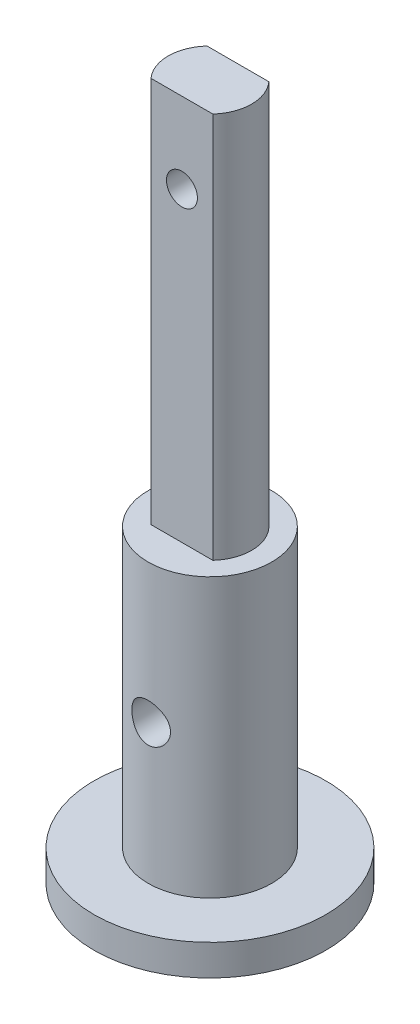
ISO-10303-21;
HEADER;
FILE_DESCRIPTION(('STEP AP214'),'2;1');
FILE_NAME('part.step','',(''),(''),'','','');
FILE_SCHEMA(('AUTOMOTIVE_DESIGN { 1 0 10303 214 1 1 1 1 }'));
ENDSEC;
DATA;
#1=APPLICATION_CONTEXT('core data for automotive mechanical design processes');
#2=APPLICATION_PROTOCOL_DEFINITION('international standard','automotive_design',2000,#1);
#3=PRODUCT_CONTEXT('',#1,'mechanical');
#4=PRODUCT('Part','Part','',(#3));
#5=PRODUCT_RELATED_PRODUCT_CATEGORY('part','',(#4));
#6=PRODUCT_DEFINITION_FORMATION('','',#4);
#7=PRODUCT_DEFINITION_CONTEXT('part definition',#1,'design');
#8=PRODUCT_DEFINITION('design','',#6,#7);
#9=PRODUCT_DEFINITION_SHAPE('','',#8);
#10=(LENGTH_UNIT() NAMED_UNIT(*) SI_UNIT(.MILLI.,.METRE.));
#11=(NAMED_UNIT(*) PLANE_ANGLE_UNIT() SI_UNIT($,.RADIAN.));
#12=(NAMED_UNIT(*) SI_UNIT($,.STERADIAN.) SOLID_ANGLE_UNIT());
#13=UNCERTAINTY_MEASURE_WITH_UNIT(LENGTH_MEASURE(1.E-05),#10,'distance_accuracy_value','');
#14=(GEOMETRIC_REPRESENTATION_CONTEXT(3) GLOBAL_UNCERTAINTY_ASSIGNED_CONTEXT((#13)) GLOBAL_UNIT_ASSIGNED_CONTEXT((#10,
#11,#12)) REPRESENTATION_CONTEXT('',''));
#15=CARTESIAN_POINT('',(0.,0.,0.));
#16=DIRECTION('',(0.,0.,1.));
#17=DIRECTION('',(1.,0.,0.));
#18=AXIS2_PLACEMENT_3D('',#15,#16,#17);
#19=CARTESIAN_POINT('',(0.,45.,0.));
#20=DIRECTION('',(0.,-1.,0.));
#21=DIRECTION('',(0.,0.,-1.));
#22=AXIS2_PLACEMENT_3D('',#19,#20,#21);
#23=CYLINDRICAL_SURFACE('',#22,4.);
#24=CARTESIAN_POINT('',(0.,2.,0.));
#25=DIRECTION('',(0.,1.,0.));
#26=DIRECTION('',(0.,0.,1.));
#27=AXIS2_PLACEMENT_3D('',#24,#25,#26);
#28=CIRCLE('',#27,4.);
#29=CARTESIAN_POINT('',(0.,2.,4.));
#30=VERTEX_POINT('',#29);
#31=EDGE_CURVE('E126',#30,#30,#28,.T.);
#32=ORIENTED_EDGE('',*,*,#31,.T.);
#33=EDGE_LOOP('',(#32));
#34=FACE_BOUND('',#33,.T.);
#35=CARTESIAN_POINT('',(0.,20.,0.));
#36=DIRECTION('',(0.,1.,0.));
#37=DIRECTION('',(0.,0.,1.));
#38=AXIS2_PLACEMENT_3D('',#35,#36,#37);
#39=CIRCLE('',#38,4.);
#40=CARTESIAN_POINT('',(0.,20.,4.));
#41=VERTEX_POINT('',#40);
#42=EDGE_CURVE('E122',#41,#41,#39,.T.);
#43=ORIENTED_EDGE('',*,*,#42,.F.);
#44=EDGE_LOOP('',(#43));
#45=FACE_BOUND('',#44,.T.);
#46=CARTESIAN_POINT('',(1.24999999999999,11.,3.79967103839267));
#47=CARTESIAN_POINT('',(1.24999953780047,11.0683470361093,3.79967145961937));
#48=CARTESIAN_POINT('',(1.24437538791494,11.1366987687032,3.80153531505043));
#49=CARTESIAN_POINT('',(1.22209175401326,11.2713941608778,3.80875638998877));
#50=CARTESIAN_POINT('',(1.20542928782514,11.3377372727322,3.81411455353136));
#51=CARTESIAN_POINT('',(1.16169788223558,11.466444901932,3.8276593883596));
#52=CARTESIAN_POINT('',(1.13464735736676,11.5288162331057,3.83584105194317));
#53=CARTESIAN_POINT('',(1.07096914173156,11.648152695864,3.85410406218688));
#54=CARTESIAN_POINT('',(1.03433975905631,11.7051168699601,3.86418574435841));
#55=CARTESIAN_POINT('',(0.951196070622286,11.8139788674935,3.8855012766862));
#56=CARTESIAN_POINT('',(0.904409399720391,11.865663609436,3.8967612338478));
#57=CARTESIAN_POINT('',(0.802862046455487,11.9605960132092,3.91894245860336));
#58=CARTESIAN_POINT('',(0.748100252518558,12.0038424969448,3.92986367872627));
#59=CARTESIAN_POINT('',(0.630625912493356,12.0816110630112,3.95043553390078));
#60=CARTESIAN_POINT('',(0.567761556520088,12.1159137038315,3.9600518456278));
#61=CARTESIAN_POINT('',(0.436804232853397,12.1733760498555,3.97662551833019));
#62=CARTESIAN_POINT('',(0.368712498487045,12.1965383741496,3.9835835041992));
#63=CARTESIAN_POINT('',(0.231464356966091,12.2303511280971,3.99387175820862));
#64=CARTESIAN_POINT('',(0.162405715468209,12.2413657497878,3.99730738984143));
#65=CARTESIAN_POINT('',(0.0233408139845136,12.2517243464375,4.00053595876015));
#66=CARTESIAN_POINT('',(-0.0466652269730901,12.2510709743588,4.00032972410065));
#67=CARTESIAN_POINT('',(-0.183074480354741,12.2383517084141,3.99637116132537));
#68=CARTESIAN_POINT('',(-0.24951863431405,12.226680616487,3.99274150972157));
#69=CARTESIAN_POINT('',(-0.379453063347776,12.192905009957,3.98249482560855));
#70=CARTESIAN_POINT('',(-0.442943145481202,12.1707998149134,3.97587759827134));
#71=CARTESIAN_POINT('',(-0.566078103154787,12.1165298109251,3.96023459729533));
#72=CARTESIAN_POINT('',(-0.625666405622837,12.084245191437,3.95118033616957));
#73=CARTESIAN_POINT('',(-0.738702511152035,12.0106289002954,3.93161722953562));
#74=CARTESIAN_POINT('',(-0.792148756208844,11.9692949408622,3.92110801644584));
#75=CARTESIAN_POINT('',(-0.893737698453887,11.8767263651987,3.89923670734646));
#76=CARTESIAN_POINT('',(-0.941566549094185,11.8251509311588,3.88785731989084));
#77=CARTESIAN_POINT('',(-1.02798974259538,11.7146048981755,3.86590615440412));
#78=CARTESIAN_POINT('',(-1.06658299775342,11.655633429425,3.85533447159846));
#79=CARTESIAN_POINT('',(-1.13380465019766,11.5310825311402,3.83610846648974));
#80=CARTESIAN_POINT('',(-1.16231680702683,11.4654365909576,3.82747690354323));
#81=CARTESIAN_POINT('',(-1.20778345948514,11.3299405081046,3.81337545338913));
#82=CARTESIAN_POINT('',(-1.22474210765794,11.2600918857895,3.80790443033293));
#83=CARTESIAN_POINT('',(-1.24601485185709,11.1211800474342,3.80099563391872));
#84=CARTESIAN_POINT('',(-1.25080954353711,11.0521980037679,3.79940466389696));
#85=CARTESIAN_POINT('',(-1.24896744498308,10.9144102585018,3.80001077463984));
#86=CARTESIAN_POINT('',(-1.24233242111456,10.8456045312995,3.80220727008389));
#87=CARTESIAN_POINT('',(-1.21824873513144,10.7121917033483,3.80998957482874));
#88=CARTESIAN_POINT('',(-1.20111831160538,10.647520725926,3.81547554101732));
#89=CARTESIAN_POINT('',(-1.15690373661028,10.521978208004,3.8291128733166));
#90=CARTESIAN_POINT('',(-1.12981796171155,10.4611072890788,3.83726467412387));
#91=CARTESIAN_POINT('',(-1.06557510655875,10.3429608902282,3.85560539653156));
#92=CARTESIAN_POINT('',(-1.02815147488558,10.2858385844072,3.86584603489733));
#93=CARTESIAN_POINT('',(-0.944606408679818,10.1785096536381,3.88710348972828));
#94=CARTESIAN_POINT('',(-0.89848271469079,10.1283048310747,3.89812050735703));
#95=CARTESIAN_POINT('',(-0.79657294775361,10.0340896340872,3.92024187562679));
#96=CARTESIAN_POINT('',(-0.740465649788527,9.99042221386013,3.93133092285679));
#97=CARTESIAN_POINT('',(-0.621451545651404,9.91310895667874,3.95189059843678));
#98=CARTESIAN_POINT('',(-0.55854505110863,9.87946266068896,3.96136130090946));
#99=CARTESIAN_POINT('',(-0.428105523331838,9.82346943752832,3.97756311928512));
#100=CARTESIAN_POINT('',(-0.360610184283762,9.80104071215631,3.984313995612));
#101=CARTESIAN_POINT('',(-0.222557254056396,9.76792746141029,3.99440242648576));
#102=CARTESIAN_POINT('',(-0.152000628340363,9.7572392609165,3.99774104914277));
#103=CARTESIAN_POINT('',(-0.0129849366489056,9.74820899825037,4.00055803404461));
#104=CARTESIAN_POINT('',(0.0554391919465156,9.74937154982924,4.0001912940739));
#105=CARTESIAN_POINT('',(0.191073221923242,9.76281181104869,3.99600978081049));
#106=CARTESIAN_POINT('',(0.258283202179562,9.77508879599194,3.99219523232619));
#107=CARTESIAN_POINT('',(0.388755118480786,9.81009400922227,3.98159570844796));
#108=CARTESIAN_POINT('',(0.452055918449475,9.83268960784537,3.97484847960205));
#109=CARTESIAN_POINT('',(0.573998425500085,9.88757082720847,3.9590794558795));
#110=CARTESIAN_POINT('',(0.632639331274476,9.91985810997342,3.95005727091358));
#111=CARTESIAN_POINT('',(0.745761694969683,9.99447275834443,3.93029896883376));
#112=CARTESIAN_POINT('',(0.800034607053106,10.037103522464,3.91951509750962));
#113=CARTESIAN_POINT('',(0.900820791399314,10.1306598894435,3.89758736547061));
#114=CARTESIAN_POINT('',(0.947331733504154,10.1815879741394,3.88644339784827));
#115=CARTESIAN_POINT('',(1.03282865911252,10.2923157198411,3.86461892577438));
#116=CARTESIAN_POINT('',(1.0715142799471,10.3523534031166,3.85396600863456));
#117=CARTESIAN_POINT('',(1.13820470748521,10.4783981202691,3.83480125279531));
#118=CARTESIAN_POINT('',(1.16621383403545,10.5444027264502,3.82628854861387));
#119=CARTESIAN_POINT('',(1.20871180435792,10.6747226173147,3.81306560440328));
#120=CARTESIAN_POINT('',(1.22414939837873,10.7387025474516,3.80809315043749));
#121=CARTESIAN_POINT('',(1.24479245816099,10.8684538320965,3.80139606482399));
#122=CARTESIAN_POINT('',(1.25000044480778,10.9342247412015,3.79967063301599));
#123=CARTESIAN_POINT('',(1.24999999999999,11.,3.79967103839267));
#124=B_SPLINE_CURVE_WITH_KNOTS('',3,(#46,#47,#48,#49,#50,#51,#52,#53,#54,#55,#56,#57,#58,#59,
#60,#61,#62,#63,#64,#65,#66,#67,#68,#69,#70,#71,#72,#73,#74,#75,#76,#77,#78,#79,#80,#81,#82,#83,
#84,#85,#86,#87,#88,#89,#90,#91,#92,#93,#94,#95,#96,#97,#98,#99,#100,#101,#102,#103,#104,#105,
#106,#107,#108,#109,#110,#111,#112,#113,#114,#115,#116,#117,#118,#119,#120,#121,#122,#123),
.UNSPECIFIED.,.T.,.F.,(4,2,2,2,2,2,2,2,2,2,2,2,2,2,2,2,2,2,2,2,2,2,2,2,2,2,2,2,2,2,2,2,2,2,2,2,
2,2,4),(0.,0.20479813754849,0.409651627059736,0.614143644118583,0.81867180492495,
1.02957080550838,1.24049922941123,1.45619821963733,1.67184647417922,1.88083722835534,
2.08978046471775,2.29150982969751,2.49325235190093,2.69746404608409,2.90172742713188,
3.11450338937334,3.32730439853776,3.54248470934454,3.75758763952753,3.96404933287936,
4.1704791221909,4.37093972044363,4.5714330225321,4.77767613309611,4.9839728801188,
5.19881937811511,5.41365603317087,5.62690239290998,5.84008198140585,6.04438802439525,
6.24868074692307,6.4504184651476,6.65219079911652,6.86080693105215,7.06948557772191,
7.28507795501705,7.50058300803822,7.69772354371386,7.89481549188779),.UNSPECIFIED.);
#125=CARTESIAN_POINT('',(1.24999999999999,11.,3.79967103839267));
#126=VERTEX_POINT('',#125);
#127=EDGE_CURVE('E135',#126,#126,#124,.T.);
#128=ORIENTED_EDGE('',*,*,#127,.F.);
#129=EDGE_LOOP('',(#128));
#130=FACE_BOUND('',#129,.T.);
#131=CARTESIAN_POINT('',(0.,12.25,-4.));
#132=CARTESIAN_POINT('',(0.0684391851745461,12.2499995534124,-3.99999965877989));
#133=CARTESIAN_POINT('',(0.136883052502858,12.2443607730555,-3.99822694984841));
#134=CARTESIAN_POINT('',(0.271769209588447,12.2220137584608,-3.99132894088807));
#135=CARTESIAN_POINT('',(0.338211042725907,12.2053030186356,-3.9862028819986));
#136=CARTESIAN_POINT('',(0.467128543650806,12.1614306288043,-3.97315815697909));
#137=CARTESIAN_POINT('',(0.529610176985804,12.134285155347,-3.96524381499025));
#138=CARTESIAN_POINT('',(0.64913480234646,12.0703826823217,-3.94743969161093));
#139=CARTESIAN_POINT('',(0.706176935444884,12.0336241682194,-3.93754959899905));
#140=CARTESIAN_POINT('',(0.814965334952279,11.9503440079826,-3.91650213740283));
#141=CARTESIAN_POINT('',(0.866520028156657,11.9035791149389,-3.90531715926989));
#142=CARTESIAN_POINT('',(0.96119738203699,11.8021316075864,-3.88310046374209));
#143=CARTESIAN_POINT('',(1.00431847289869,11.7474475225054,-3.87206877523457));
#144=CARTESIAN_POINT('',(1.08194336483113,11.6300554361919,-3.85111144698172));
#145=CARTESIAN_POINT('',(1.11620784150128,11.5671825224728,-3.84121988301796));
#146=CARTESIAN_POINT('',(1.17359741076671,11.4362076850181,-3.82407801799234));
#147=CARTESIAN_POINT('',(1.19672543771944,11.3681071442061,-3.81682702128689));
#148=CARTESIAN_POINT('',(1.23048459930033,11.2307719225479,-3.80607606984501));
#149=CARTESIAN_POINT('',(1.24147110007864,11.1616331563611,-3.80246972929508));
#150=CARTESIAN_POINT('',(1.25174555036988,11.0224068810881,-3.7991005514095));
#151=CARTESIAN_POINT('',(1.25103660995771,10.9523196291783,-3.79933669227334));
#152=CARTESIAN_POINT('',(1.23821824732739,10.816125539731,-3.80353189075438));
#153=CARTESIAN_POINT('',(1.22656057869382,10.7499708741384,-3.80734341745949));
#154=CARTESIAN_POINT('',(1.19290813355625,10.6206078434626,-3.81802025652489));
#155=CARTESIAN_POINT('',(1.1709122584455,10.5573997922912,-3.82488589343115));
#156=CARTESIAN_POINT('',(1.11688874681276,10.4346480555674,-3.84101044014297));
#157=CARTESIAN_POINT('',(1.08471925662081,10.375171389308,-3.85030284660825));
#158=CARTESIAN_POINT('',(1.01136020737847,10.2623122321209,-3.8702185658007));
#159=CARTESIAN_POINT('',(0.970168305215762,10.2089313297463,-3.88084222394551));
#160=CARTESIAN_POINT('',(0.877716954182113,10.107225056583,-3.90281527800493));
#161=CARTESIAN_POINT('',(0.826084570592806,10.0592404422203,-3.91417569605696));
#162=CARTESIAN_POINT('',(0.715364408095519,9.97252810642031,-3.9359157075958));
#163=CARTESIAN_POINT('',(0.656276077349009,9.93380107078078,-3.94629522838372));
#164=CARTESIAN_POINT('',(0.531664610465443,9.86647231139872,-3.96501294890191));
#165=CARTESIAN_POINT('',(0.466094906919268,9.83795186453602,-3.97333460648208));
#166=CARTESIAN_POINT('',(0.330767977782633,9.79244699914843,-3.98687955828554));
#167=CARTESIAN_POINT('',(0.261012030724597,9.7754590777616,-3.99210379325151));
#168=CARTESIAN_POINT('',(0.122185157290333,9.75408195742101,-3.99871389395014));
#169=CARTESIAN_POINT('',(0.0531918487888302,9.74923145640647,-4.00024022895439));
#170=CARTESIAN_POINT('',(-0.0846303057325967,9.75096622663733,-3.99969799730981));
#171=CARTESIAN_POINT('',(-0.153459174306517,9.7575498273226,-3.99762995581125));
#172=CARTESIAN_POINT('',(-0.287219332975863,9.78159559260639,-3.99022363769772));
#173=CARTESIAN_POINT('',(-0.352204978420959,9.79878326761251,-3.98496793110725));
#174=CARTESIAN_POINT('',(-0.478351928861376,9.84321435236669,-3.97180121379252));
#175=CARTESIAN_POINT('',(-0.539512760449027,9.87045900402491,-3.96388987514203));
#176=CARTESIAN_POINT('',(-0.657932406672243,9.93497321654879,-3.94598542759567));
#177=CARTESIAN_POINT('',(-0.715059739787967,9.97247098749722,-3.9359462681821));
#178=CARTESIAN_POINT('',(-0.822365850960107,10.056153210117,-3.91493410002887));
#179=CARTESIAN_POINT('',(-0.872542738043347,10.1023400177431,-3.90396083845861));
#180=CARTESIAN_POINT('',(-0.966587462919666,10.2042588900537,-3.88176994885247));
#181=CARTESIAN_POINT('',(-1.01012652339775,10.2602966637453,-3.87055986714445));
#182=CARTESIAN_POINT('',(-1.0872125024491,10.3791266163707,-3.84961947087601));
#183=CARTESIAN_POINT('',(-1.12075957972525,10.4419186880044,-3.83988913281399));
#184=CARTESIAN_POINT('',(-1.17670083481142,10.5723451728859,-3.82311782360753));
#185=CARTESIAN_POINT('',(-1.19913819558886,10.6399596495047,-3.81606646468027));
#186=CARTESIAN_POINT('',(-1.23222894320964,10.7782724933238,-3.80551170941212));
#187=CARTESIAN_POINT('',(-1.24288681414611,10.8489696763713,-3.80200696302675));
#188=CARTESIAN_POINT('',(-1.25179406157541,10.9880040875542,-3.79908292712494));
#189=CARTESIAN_POINT('',(-1.25058279621958,11.0563034538129,-3.79948604683076));
#190=CARTESIAN_POINT('',(-1.23708818129474,11.1916745849192,-3.80390090472383));
#191=CARTESIAN_POINT('',(-1.2248053482256,11.258746406884,-3.80791247457319));
#192=CARTESIAN_POINT('',(-1.18987729913378,11.3887940396018,-3.81896814158112));
#193=CARTESIAN_POINT('',(-1.16738642405944,11.451815441096,-3.82596698183474));
#194=CARTESIAN_POINT('',(-1.11280227335064,11.5732404135313,-3.84219704261348));
#195=CARTESIAN_POINT('',(-1.08070704444255,11.6316430420777,-3.85142871716522));
#196=CARTESIAN_POINT('',(-1.00635675013475,11.7446459704406,-3.8715348703158));
#197=CARTESIAN_POINT('',(-0.963753335241276,11.7990081295004,-3.88245948922441));
#198=CARTESIAN_POINT('',(-0.87020899640485,11.8999863281118,-3.90448998821726));
#199=CARTESIAN_POINT('',(-0.819265842344404,11.946600288991,-3.91559591606795));
#200=CARTESIAN_POINT('',(-0.708486662823334,12.032282538363,-3.93717271952329));
#201=CARTESIAN_POINT('',(-0.648414574487381,12.07105473645,-3.94761101730634));
#202=CARTESIAN_POINT('',(-0.522279138013654,12.1378989151394,-3.96626769296916));
#203=CARTESIAN_POINT('',(-0.45621815779545,12.1659751021418,-3.97448694315832));
#204=CARTESIAN_POINT('',(-0.325747635373977,12.2085913676085,-3.98720650733461));
#205=CARTESIAN_POINT('',(-0.261670337112546,12.2240748673053,-3.99196240806139));
#206=CARTESIAN_POINT('',(-0.131729895440247,12.2447783599677,-3.99835900340486));
#207=CARTESIAN_POINT('',(-0.0658671161396745,12.250000429804,-4.00000032839644));
#208=CARTESIAN_POINT('',(0.,12.25,-4.));
#209=B_SPLINE_CURVE_WITH_KNOTS('',3,(#131,#132,#133,#134,#135,#136,#137,#138,#139,#140,#141,
#142,#143,#144,#145,#146,#147,#148,#149,#150,#151,#152,#153,#154,#155,#156,#157,#158,#159,#160,
#161,#162,#163,#164,#165,#166,#167,#168,#169,#170,#171,#172,#173,#174,#175,#176,#177,#178,#179,
#180,#181,#182,#183,#184,#185,#186,#187,#188,#189,#190,#191,#192,#193,#194,#195,#196,#197,#198,
#199,#200,#201,#202,#203,#204,#205,#206,#207,#208),.UNSPECIFIED.,.T.,.F.,(4,2,2,2,2,2,2,2,2,2,2,
2,2,2,2,2,2,2,2,2,2,2,2,2,2,2,2,2,2,2,2,2,2,2,2,2,2,2,4),(0.,0.205075449432509,
0.410197323349067,0.615002479202438,0.819839921558391,1.03037822195158,1.24095567431276,
1.45673771247494,1.67246286279527,1.8816915016721,2.09086450295138,2.29176917422169,
2.49269519979063,2.69655642720545,2.90047066010359,3.113667472796,3.32688007413303,
3.5417546068977,3.75656384494554,3.96307568548238,4.16955735649363,4.37090626722872,
4.572280050345,4.77856324738344,4.98490245709259,5.1994177871314,5.41392970983712,
5.62760115751031,5.84119123892431,6.04512203476054,6.24904331751085,6.44997913396671,
6.65095584330174,6.85979514006362,7.06869037373341,7.28440668126413,7.50003806666338,
7.69744636651541,7.89481470763048),.UNSPECIFIED.);
#210=CARTESIAN_POINT('',(0.,12.25,-4.));
#211=VERTEX_POINT('',#210);
#212=EDGE_CURVE('E42',#211,#211,#209,.T.);
#213=ORIENTED_EDGE('',*,*,#212,.F.);
#214=EDGE_LOOP('',(#213));
#215=FACE_BOUND('',#214,.T.);
#216=ADVANCED_FACE('F38',(#34,#45,#130,#215),#23,.T.);
#217=CARTESIAN_POINT('',(0.,2.,0.));
#218=DIRECTION('',(0.,1.,0.));
#219=DIRECTION('',(0.,0.,1.));
#220=AXIS2_PLACEMENT_3D('',#217,#218,#219);
#221=PLANE('',#220);
#222=CARTESIAN_POINT('',(0.,2.,0.));
#223=DIRECTION('',(0.,1.,0.));
#224=DIRECTION('',(0.,0.,1.));
#225=AXIS2_PLACEMENT_3D('',#222,#223,#224);
#226=CIRCLE('',#225,7.5);
#227=CARTESIAN_POINT('',(0.,2.,7.5));
#228=VERTEX_POINT('',#227);
#229=EDGE_CURVE('E11',#228,#228,#226,.T.);
#230=ORIENTED_EDGE('',*,*,#229,.T.);
#231=EDGE_LOOP('',(#230));
#232=FACE_BOUND('',#231,.T.);
#233=ORIENTED_EDGE('',*,*,#31,.F.);
#234=EDGE_LOOP('',(#233));
#235=FACE_BOUND('',#234,.T.);
#236=ADVANCED_FACE('F172',(#232,#235),#221,.T.);
#237=CARTESIAN_POINT('',(0.,0.,0.));
#238=DIRECTION('',(0.,1.,0.));
#239=DIRECTION('',(0.,0.,1.));
#240=AXIS2_PLACEMENT_3D('',#237,#238,#239);
#241=PLANE('',#240);
#242=CARTESIAN_POINT('',(0.,0.,0.));
#243=DIRECTION('',(0.,1.,0.));
#244=DIRECTION('',(0.,0.,1.));
#245=AXIS2_PLACEMENT_3D('',#242,#243,#244);
#246=CIRCLE('',#245,7.5);
#247=CARTESIAN_POINT('',(0.,0.,7.5));
#248=VERTEX_POINT('',#247);
#249=EDGE_CURVE('E52',#248,#248,#246,.T.);
#250=ORIENTED_EDGE('',*,*,#249,.F.);
#251=EDGE_LOOP('',(#250));
#252=FACE_BOUND('',#251,.T.);
#253=ADVANCED_FACE('F177',(#252),#241,.F.);
#254=CARTESIAN_POINT('',(0.,2.,0.));
#255=DIRECTION('',(0.,-1.,0.));
#256=DIRECTION('',(0.,0.,-1.));
#257=AXIS2_PLACEMENT_3D('',#254,#255,#256);
#258=CYLINDRICAL_SURFACE('',#257,7.5);
#259=ORIENTED_EDGE('',*,*,#229,.F.);
#260=EDGE_LOOP('',(#259));
#261=FACE_BOUND('',#260,.T.);
#262=ORIENTED_EDGE('',*,*,#249,.T.);
#263=EDGE_LOOP('',(#262));
#264=FACE_BOUND('',#263,.T.);
#265=ADVANCED_FACE('F40',(#261,#264),#258,.T.);
#266=CARTESIAN_POINT('',(0.,20.,0.));
#267=DIRECTION('',(0.,1.,0.));
#268=DIRECTION('',(0.,0.,1.));
#269=AXIS2_PLACEMENT_3D('',#266,#267,#268);
#270=PLANE('',#269);
#271=DIRECTION('',(-1.,0.,0.));
#272=VECTOR('',#271,1.);
#273=CARTESIAN_POINT('',(-2.,20.,-1.8113761853665));
#274=LINE('',#273,#272);
#275=CARTESIAN_POINT('',(2.,20.,-1.8113761853665));
#276=VERTEX_POINT('',#275);
#277=CARTESIAN_POINT('',(-2.,20.,-1.8113761853665));
#278=VERTEX_POINT('',#277);
#279=EDGE_CURVE('E98',#276,#278,#274,.T.);
#280=ORIENTED_EDGE('',*,*,#279,.F.);
#281=CARTESIAN_POINT('',(0.,20.,0.));
#282=DIRECTION('',(0.,1.,0.));
#283=DIRECTION('',(0.,0.,1.));
#284=AXIS2_PLACEMENT_3D('',#281,#282,#283);
#285=CIRCLE('',#284,2.69834832534884);
#286=CARTESIAN_POINT('',(2.,20.,1.8113761853665));
#287=VERTEX_POINT('',#286);
#288=EDGE_CURVE('E68',#287,#276,#285,.T.);
#289=ORIENTED_EDGE('',*,*,#288,.F.);
#290=DIRECTION('',(1.,0.,0.));
#291=VECTOR('',#290,1.);
#292=CARTESIAN_POINT('',(-2.,20.,1.8113761853665));
#293=LINE('',#292,#291);
#294=CARTESIAN_POINT('',(-2.,20.,1.8113761853665));
#295=VERTEX_POINT('',#294);
#296=EDGE_CURVE('E90',#295,#287,#293,.T.);
#297=ORIENTED_EDGE('',*,*,#296,.F.);
#298=CARTESIAN_POINT('',(0.,20.,0.));
#299=DIRECTION('',(0.,1.,0.));
#300=DIRECTION('',(0.,0.,1.));
#301=AXIS2_PLACEMENT_3D('',#298,#299,#300);
#302=CIRCLE('',#301,2.69834832534884);
#303=EDGE_CURVE('E103',#278,#295,#302,.T.);
#304=ORIENTED_EDGE('',*,*,#303,.F.);
#305=EDGE_LOOP('',(#280,#289,#297,#304));
#306=FACE_BOUND('',#305,.T.);
#307=ORIENTED_EDGE('',*,*,#42,.T.);
#308=EDGE_LOOP('',(#307));
#309=FACE_BOUND('',#308,.T.);
#310=ADVANCED_FACE('F101',(#306,#309),#270,.T.);
#311=CARTESIAN_POINT('',(0.,20.,0.));
#312=DIRECTION('',(0.,1.,0.));
#313=DIRECTION('',(0.,0.,1.));
#314=AXIS2_PLACEMENT_3D('',#311,#312,#313);
#315=CYLINDRICAL_SURFACE('',#314,2.69834832534884);
#316=CARTESIAN_POINT('',(0.,45.,0.));
#317=DIRECTION('',(0.,1.,0.));
#318=DIRECTION('',(0.,0.,1.));
#319=AXIS2_PLACEMENT_3D('',#316,#317,#318);
#320=CIRCLE('',#319,2.69834832534884);
#321=CARTESIAN_POINT('',(-2.,45.,-1.8113761853665));
#322=VERTEX_POINT('',#321);
#323=CARTESIAN_POINT('',(-2.,45.,1.8113761853665));
#324=VERTEX_POINT('',#323);
#325=EDGE_CURVE('E117',#322,#324,#320,.T.);
#326=ORIENTED_EDGE('',*,*,#325,.F.);
#327=DIRECTION('',(0.,1.,0.));
#328=VECTOR('',#327,1.);
#329=CARTESIAN_POINT('',(-2.,20.,-1.8113761853665));
#330=LINE('',#329,#328);
#331=EDGE_CURVE('E107',#278,#322,#330,.T.);
#332=ORIENTED_EDGE('',*,*,#331,.F.);
#333=ORIENTED_EDGE('',*,*,#303,.T.);
#334=DIRECTION('',(0.,1.,0.));
#335=VECTOR('',#334,1.);
#336=CARTESIAN_POINT('',(-2.,20.,1.8113761853665));
#337=LINE('',#336,#335);
#338=EDGE_CURVE('E88',#295,#324,#337,.T.);
#339=ORIENTED_EDGE('',*,*,#338,.T.);
#340=EDGE_LOOP('',(#326,#332,#333,#339));
#341=FACE_BOUND('',#340,.T.);
#342=ADVANCED_FACE('F106',(#341),#315,.T.);
#343=CARTESIAN_POINT('',(-2.,20.,-1.8113761853665));
#344=DIRECTION('',(0.,0.,-1.));
#345=DIRECTION('',(-1.,0.,0.));
#346=AXIS2_PLACEMENT_3D('',#343,#344,#345);
#347=PLANE('',#346);
#348=CARTESIAN_POINT('',(0.,39.7943098120983,-1.8113761853665));
#349=DIRECTION('',(0.,0.,-1.));
#350=DIRECTION('',(-1.,0.,0.));
#351=AXIS2_PLACEMENT_3D('',#348,#349,#350);
#352=CIRCLE('',#351,1.);
#353=CARTESIAN_POINT('',(-1.,39.7943098120983,-1.8113761853665));
#354=VERTEX_POINT('',#353);
#355=EDGE_CURVE('E113',#354,#354,#352,.F.);
#356=ORIENTED_EDGE('',*,*,#355,.T.);
#357=EDGE_LOOP('',(#356));
#358=FACE_BOUND('',#357,.T.);
#359=DIRECTION('',(-1.,0.,0.));
#360=VECTOR('',#359,1.);
#361=CARTESIAN_POINT('',(-2.,45.,-1.8113761853665));
#362=LINE('',#361,#360);
#363=CARTESIAN_POINT('',(2.,45.,-1.8113761853665));
#364=VERTEX_POINT('',#363);
#365=EDGE_CURVE('E108',#364,#322,#362,.T.);
#366=ORIENTED_EDGE('',*,*,#365,.F.);
#367=DIRECTION('',(0.,1.,0.));
#368=VECTOR('',#367,1.);
#369=CARTESIAN_POINT('',(2.,20.,-1.8113761853665));
#370=LINE('',#369,#368);
#371=EDGE_CURVE('E123',#276,#364,#370,.T.);
#372=ORIENTED_EDGE('',*,*,#371,.F.);
#373=ORIENTED_EDGE('',*,*,#279,.T.);
#374=ORIENTED_EDGE('',*,*,#331,.T.);
#375=EDGE_LOOP('',(#366,#372,#373,#374));
#376=FACE_BOUND('',#375,.T.);
#377=ADVANCED_FACE('F154',(#358,#376),#347,.T.);
#378=CARTESIAN_POINT('',(0.,20.,0.));
#379=DIRECTION('',(0.,1.,0.));
#380=DIRECTION('',(0.,0.,1.));
#381=AXIS2_PLACEMENT_3D('',#378,#379,#380);
#382=CYLINDRICAL_SURFACE('',#381,2.69834832534884);
#383=CARTESIAN_POINT('',(0.,45.,0.));
#384=DIRECTION('',(0.,1.,0.));
#385=DIRECTION('',(0.,0.,1.));
#386=AXIS2_PLACEMENT_3D('',#383,#384,#385);
#387=CIRCLE('',#386,2.69834832534884);
#388=CARTESIAN_POINT('',(2.,45.,1.8113761853665));
#389=VERTEX_POINT('',#388);
#390=EDGE_CURVE('E60',#389,#364,#387,.T.);
#391=ORIENTED_EDGE('',*,*,#390,.F.);
#392=DIRECTION('',(0.,1.,0.));
#393=VECTOR('',#392,1.);
#394=CARTESIAN_POINT('',(2.,20.,1.8113761853665));
#395=LINE('',#394,#393);
#396=EDGE_CURVE('E97',#287,#389,#395,.T.);
#397=ORIENTED_EDGE('',*,*,#396,.F.);
#398=ORIENTED_EDGE('',*,*,#288,.T.);
#399=ORIENTED_EDGE('',*,*,#371,.T.);
#400=EDGE_LOOP('',(#391,#397,#398,#399));
#401=FACE_BOUND('',#400,.T.);
#402=ADVANCED_FACE('F157',(#401),#382,.T.);
#403=CARTESIAN_POINT('',(-2.,20.,1.8113761853665));
#404=DIRECTION('',(0.,0.,1.));
#405=DIRECTION('',(1.,0.,0.));
#406=AXIS2_PLACEMENT_3D('',#403,#404,#405);
#407=PLANE('',#406);
#408=CARTESIAN_POINT('',(0.,39.7943098120983,1.8113761853665));
#409=DIRECTION('',(0.,0.,1.));
#410=DIRECTION('',(1.,0.,0.));
#411=AXIS2_PLACEMENT_3D('',#408,#409,#410);
#412=CIRCLE('',#411,1.);
#413=CARTESIAN_POINT('',(1.,39.7943098120983,1.8113761853665));
#414=VERTEX_POINT('',#413);
#415=EDGE_CURVE('E133',#414,#414,#412,.F.);
#416=ORIENTED_EDGE('',*,*,#415,.T.);
#417=EDGE_LOOP('',(#416));
#418=FACE_BOUND('',#417,.T.);
#419=DIRECTION('',(1.,0.,0.));
#420=VECTOR('',#419,1.);
#421=CARTESIAN_POINT('',(-2.,45.,1.8113761853665));
#422=LINE('',#421,#420);
#423=EDGE_CURVE('E92',#324,#389,#422,.T.);
#424=ORIENTED_EDGE('',*,*,#423,.F.);
#425=ORIENTED_EDGE('',*,*,#338,.F.);
#426=ORIENTED_EDGE('',*,*,#296,.T.);
#427=ORIENTED_EDGE('',*,*,#396,.T.);
#428=EDGE_LOOP('',(#424,#425,#426,#427));
#429=FACE_BOUND('',#428,.T.);
#430=ADVANCED_FACE('F89',(#418,#429),#407,.T.);
#431=CARTESIAN_POINT('',(0.,45.,0.));
#432=DIRECTION('',(0.,1.,0.));
#433=DIRECTION('',(0.,0.,1.));
#434=AXIS2_PLACEMENT_3D('',#431,#432,#433);
#435=PLANE('',#434);
#436=ORIENTED_EDGE('',*,*,#365,.T.);
#437=ORIENTED_EDGE('',*,*,#325,.T.);
#438=ORIENTED_EDGE('',*,*,#423,.T.);
#439=ORIENTED_EDGE('',*,*,#390,.T.);
#440=EDGE_LOOP('',(#436,#437,#438,#439));
#441=FACE_BOUND('',#440,.T.);
#442=ADVANCED_FACE('F152',(#441),#435,.T.);
#443=CARTESIAN_POINT('',(0.,39.7943098120983,-26.8113761853665));
#444=DIRECTION('',(0.,0.,1.));
#445=DIRECTION('',(1.,0.,0.));
#446=AXIS2_PLACEMENT_3D('',#443,#444,#445);
#447=CYLINDRICAL_SURFACE('',#446,1.);
#448=ORIENTED_EDGE('',*,*,#355,.F.);
#449=EDGE_LOOP('',(#448));
#450=FACE_BOUND('',#449,.T.);
#451=ORIENTED_EDGE('',*,*,#415,.F.);
#452=EDGE_LOOP('',(#451));
#453=FACE_BOUND('',#452,.T.);
#454=ADVANCED_FACE('F147',(#450,#453),#447,.F.);
#455=CARTESIAN_POINT('',(0.,11.,-26.8113761853665));
#456=DIRECTION('',(0.,0.,1.));
#457=DIRECTION('',(1.,0.,0.));
#458=AXIS2_PLACEMENT_3D('',#455,#456,#457);
#459=CYLINDRICAL_SURFACE('',#458,1.25);
#460=ORIENTED_EDGE('',*,*,#127,.T.);
#461=EDGE_LOOP('',(#460));
#462=FACE_BOUND('',#461,.T.);
#463=ORIENTED_EDGE('',*,*,#212,.T.);
#464=EDGE_LOOP('',(#463));
#465=FACE_BOUND('',#464,.T.);
#466=ADVANCED_FACE('F143',(#462,#465),#459,.F.);
#467=CLOSED_SHELL('',(#216,#236,#253,#265,#310,#342,#377,#402,#430,#442,#454,#466));
#468=MANIFOLD_SOLID_BREP('B2',#467);
#469=ADVANCED_BREP_SHAPE_REPRESENTATION('',(#18,#468),#14);
#470=SHAPE_DEFINITION_REPRESENTATION(#9,#469);
ENDSEC;
END-ISO-10303-21;
